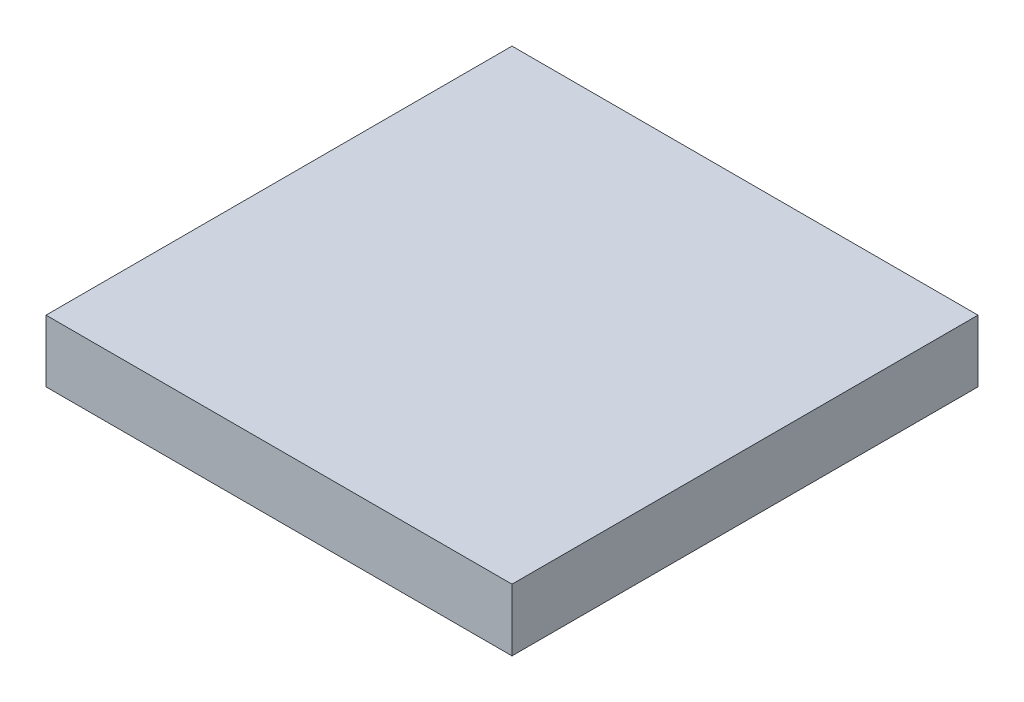
ISO-10303-21;
HEADER;
FILE_DESCRIPTION(('STEP AP214'),'2;1');
FILE_NAME('part.step','',(''),(''),'','','');
FILE_SCHEMA(('AUTOMOTIVE_DESIGN { 1 0 10303 214 1 1 1 1 }'));
ENDSEC;
DATA;
#1=APPLICATION_CONTEXT('core data for automotive mechanical design processes');
#2=APPLICATION_PROTOCOL_DEFINITION('international standard','automotive_design',2000,#1);
#3=PRODUCT_CONTEXT('',#1,'mechanical');
#4=PRODUCT('Part','Part','',(#3));
#5=PRODUCT_RELATED_PRODUCT_CATEGORY('part','',(#4));
#6=PRODUCT_DEFINITION_FORMATION('','',#4);
#7=PRODUCT_DEFINITION_CONTEXT('part definition',#1,'design');
#8=PRODUCT_DEFINITION('design','',#6,#7);
#9=PRODUCT_DEFINITION_SHAPE('','',#8);
#10=(LENGTH_UNIT() NAMED_UNIT(*) SI_UNIT(.MILLI.,.METRE.));
#11=(NAMED_UNIT(*) PLANE_ANGLE_UNIT() SI_UNIT($,.RADIAN.));
#12=(NAMED_UNIT(*) SI_UNIT($,.STERADIAN.) SOLID_ANGLE_UNIT());
#13=UNCERTAINTY_MEASURE_WITH_UNIT(LENGTH_MEASURE(1.E-05),#10,'distance_accuracy_value','');
#14=(GEOMETRIC_REPRESENTATION_CONTEXT(3) GLOBAL_UNCERTAINTY_ASSIGNED_CONTEXT((#13)) GLOBAL_UNIT_ASSIGNED_CONTEXT((#10,
#11,#12)) REPRESENTATION_CONTEXT('',''));
#15=CARTESIAN_POINT('',(0.,0.,0.));
#16=DIRECTION('',(0.,0.,1.));
#17=DIRECTION('',(1.,0.,0.));
#18=AXIS2_PLACEMENT_3D('',#15,#16,#17);
#19=CARTESIAN_POINT('',(-1.5,0.4,-1.5));
#20=DIRECTION('',(1.,0.,0.));
#21=DIRECTION('',(0.,0.,-1.));
#22=AXIS2_PLACEMENT_3D('',#19,#20,#21);
#23=PLANE('',#22);
#24=DIRECTION('',(0.,0.,1.));
#25=VECTOR('',#24,1.);
#26=CARTESIAN_POINT('',(-1.5,0.,-1.5));
#27=LINE('',#26,#25);
#28=CARTESIAN_POINT('',(-1.5,0.,-1.5));
#29=VERTEX_POINT('',#28);
#30=CARTESIAN_POINT('',(-1.5,0.,1.5));
#31=VERTEX_POINT('',#30);
#32=EDGE_CURVE('E98',#29,#31,#27,.T.);
#33=ORIENTED_EDGE('',*,*,#32,.T.);
#34=DIRECTION('',(0.,-1.,0.));
#35=VECTOR('',#34,1.);
#36=CARTESIAN_POINT('',(-1.5,0.4,1.5));
#37=LINE('',#36,#35);
#38=CARTESIAN_POINT('',(-1.5,0.4,1.5));
#39=VERTEX_POINT('',#38);
#40=EDGE_CURVE('E11',#39,#31,#37,.T.);
#41=ORIENTED_EDGE('',*,*,#40,.F.);
#42=DIRECTION('',(0.,0.,1.));
#43=VECTOR('',#42,1.);
#44=CARTESIAN_POINT('',(-1.5,0.4,-1.5));
#45=LINE('',#44,#43);
#46=CARTESIAN_POINT('',(-1.5,0.4,-1.5));
#47=VERTEX_POINT('',#46);
#48=EDGE_CURVE('E86',#47,#39,#45,.T.);
#49=ORIENTED_EDGE('',*,*,#48,.F.);
#50=DIRECTION('',(0.,-1.,0.));
#51=VECTOR('',#50,1.);
#52=CARTESIAN_POINT('',(-1.5,0.4,-1.5));
#53=LINE('',#52,#51);
#54=EDGE_CURVE('E94',#47,#29,#53,.T.);
#55=ORIENTED_EDGE('',*,*,#54,.T.);
#56=EDGE_LOOP('',(#33,#41,#49,#55));
#57=FACE_BOUND('',#56,.T.);
#58=ADVANCED_FACE('F35',(#57),#23,.F.);
#59=CARTESIAN_POINT('',(-1.5,0.4,1.5));
#60=DIRECTION('',(0.,0.,-1.));
#61=DIRECTION('',(-1.,0.,0.));
#62=AXIS2_PLACEMENT_3D('',#59,#60,#61);
#63=PLANE('',#62);
#64=DIRECTION('',(1.,0.,0.));
#65=VECTOR('',#64,1.);
#66=CARTESIAN_POINT('',(-1.5,0.,1.5));
#67=LINE('',#66,#65);
#68=CARTESIAN_POINT('',(1.5,0.,1.5));
#69=VERTEX_POINT('',#68);
#70=EDGE_CURVE('E90',#31,#69,#67,.T.);
#71=ORIENTED_EDGE('',*,*,#70,.T.);
#72=DIRECTION('',(0.,-1.,0.));
#73=VECTOR('',#72,1.);
#74=CARTESIAN_POINT('',(1.5,0.4,1.5));
#75=LINE('',#74,#73);
#76=CARTESIAN_POINT('',(1.5,0.4,1.5));
#77=VERTEX_POINT('',#76);
#78=EDGE_CURVE('E43',#77,#69,#75,.T.);
#79=ORIENTED_EDGE('',*,*,#78,.F.);
#80=DIRECTION('',(1.,0.,0.));
#81=VECTOR('',#80,1.);
#82=CARTESIAN_POINT('',(-1.5,0.4,1.5));
#83=LINE('',#82,#81);
#84=EDGE_CURVE('E81',#39,#77,#83,.T.);
#85=ORIENTED_EDGE('',*,*,#84,.F.);
#86=ORIENTED_EDGE('',*,*,#40,.T.);
#87=EDGE_LOOP('',(#71,#79,#85,#86));
#88=FACE_BOUND('',#87,.T.);
#89=ADVANCED_FACE('F89',(#88),#63,.F.);
#90=CARTESIAN_POINT('',(1.5,0.4,-1.5));
#91=DIRECTION('',(-1.,0.,0.));
#92=DIRECTION('',(0.,0.,1.));
#93=AXIS2_PLACEMENT_3D('',#90,#91,#92);
#94=PLANE('',#93);
#95=DIRECTION('',(0.,0.,-1.));
#96=VECTOR('',#95,1.);
#97=CARTESIAN_POINT('',(1.5,0.,-1.5));
#98=LINE('',#97,#96);
#99=CARTESIAN_POINT('',(1.5,0.,-1.5));
#100=VERTEX_POINT('',#99);
#101=EDGE_CURVE('E68',#69,#100,#98,.T.);
#102=ORIENTED_EDGE('',*,*,#101,.T.);
#103=DIRECTION('',(0.,-1.,0.));
#104=VECTOR('',#103,1.);
#105=CARTESIAN_POINT('',(1.5,0.4,-1.5));
#106=LINE('',#105,#104);
#107=CARTESIAN_POINT('',(1.5,0.4,-1.5));
#108=VERTEX_POINT('',#107);
#109=EDGE_CURVE('E91',#108,#100,#106,.T.);
#110=ORIENTED_EDGE('',*,*,#109,.F.);
#111=DIRECTION('',(0.,0.,-1.));
#112=VECTOR('',#111,1.);
#113=CARTESIAN_POINT('',(1.5,0.4,-1.5));
#114=LINE('',#113,#112);
#115=EDGE_CURVE('E84',#77,#108,#114,.T.);
#116=ORIENTED_EDGE('',*,*,#115,.F.);
#117=ORIENTED_EDGE('',*,*,#78,.T.);
#118=EDGE_LOOP('',(#102,#110,#116,#117));
#119=FACE_BOUND('',#118,.T.);
#120=ADVANCED_FACE('F92',(#119),#94,.F.);
#121=CARTESIAN_POINT('',(-1.5,0.4,-1.5));
#122=DIRECTION('',(0.,0.,1.));
#123=DIRECTION('',(1.,0.,0.));
#124=AXIS2_PLACEMENT_3D('',#121,#122,#123);
#125=PLANE('',#124);
#126=DIRECTION('',(-1.,0.,0.));
#127=VECTOR('',#126,1.);
#128=CARTESIAN_POINT('',(-1.5,0.,-1.5));
#129=LINE('',#128,#127);
#130=EDGE_CURVE('E74',#100,#29,#129,.T.);
#131=ORIENTED_EDGE('',*,*,#130,.T.);
#132=ORIENTED_EDGE('',*,*,#54,.F.);
#133=DIRECTION('',(-1.,0.,0.));
#134=VECTOR('',#133,1.);
#135=CARTESIAN_POINT('',(-1.5,0.4,-1.5));
#136=LINE('',#135,#134);
#137=EDGE_CURVE('E51',#108,#47,#136,.T.);
#138=ORIENTED_EDGE('',*,*,#137,.F.);
#139=ORIENTED_EDGE('',*,*,#109,.T.);
#140=EDGE_LOOP('',(#131,#132,#138,#139));
#141=FACE_BOUND('',#140,.T.);
#142=ADVANCED_FACE('F105',(#141),#125,.F.);
#143=CARTESIAN_POINT('',(0.,0.4,0.));
#144=DIRECTION('',(0.,1.,0.));
#145=DIRECTION('',(0.,0.,1.));
#146=AXIS2_PLACEMENT_3D('',#143,#144,#145);
#147=PLANE('',#146);
#148=ORIENTED_EDGE('',*,*,#48,.T.);
#149=ORIENTED_EDGE('',*,*,#84,.T.);
#150=ORIENTED_EDGE('',*,*,#115,.T.);
#151=ORIENTED_EDGE('',*,*,#137,.T.);
#152=EDGE_LOOP('',(#148,#149,#150,#151));
#153=FACE_BOUND('',#152,.T.);
#154=ADVANCED_FACE('F82',(#153),#147,.T.);
#155=CARTESIAN_POINT('',(0.,0.,0.));
#156=DIRECTION('',(0.,1.,0.));
#157=DIRECTION('',(0.,0.,1.));
#158=AXIS2_PLACEMENT_3D('',#155,#156,#157);
#159=PLANE('',#158);
#160=ORIENTED_EDGE('',*,*,#32,.F.);
#161=ORIENTED_EDGE('',*,*,#130,.F.);
#162=ORIENTED_EDGE('',*,*,#101,.F.);
#163=ORIENTED_EDGE('',*,*,#70,.F.);
#164=EDGE_LOOP('',(#160,#161,#162,#163));
#165=FACE_BOUND('',#164,.T.);
#166=ADVANCED_FACE('F108',(#165),#159,.F.);
#167=CLOSED_SHELL('',(#58,#89,#120,#142,#154,#166));
#168=MANIFOLD_SOLID_BREP('B2',#167);
#169=ADVANCED_BREP_SHAPE_REPRESENTATION('',(#18,#168),#14);
#170=SHAPE_DEFINITION_REPRESENTATION(#9,#169);
ENDSEC;
END-ISO-10303-21;
